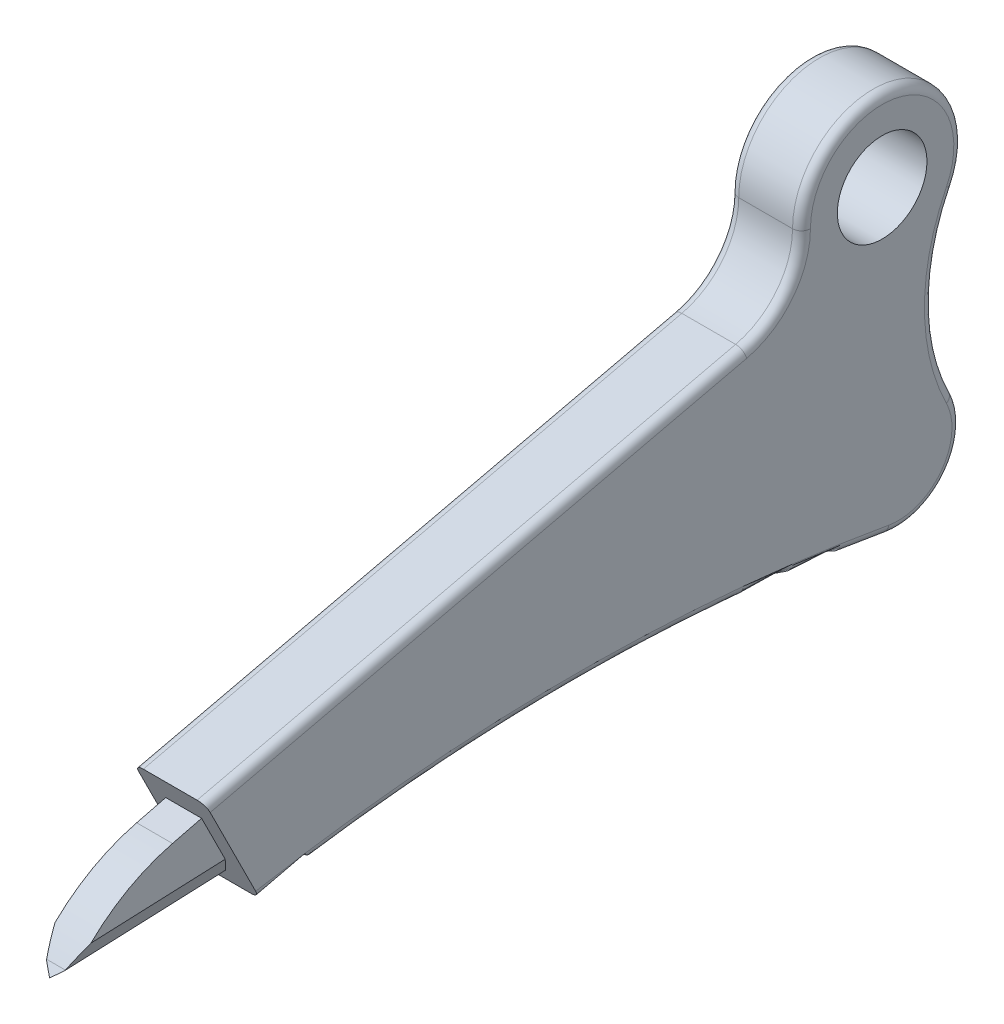
ISO-10303-21;
HEADER;
FILE_DESCRIPTION(('STEP AP214'),'2;1');
FILE_NAME('part.step','',(''),(''),'','','');
FILE_SCHEMA(('AUTOMOTIVE_DESIGN { 1 0 10303 214 1 1 1 1 }'));
ENDSEC;
DATA;
#1=APPLICATION_CONTEXT('core data for automotive mechanical design processes');
#2=APPLICATION_PROTOCOL_DEFINITION('international standard','automotive_design',2000,#1);
#3=PRODUCT_CONTEXT('',#1,'mechanical');
#4=PRODUCT('Part','Part','',(#3));
#5=PRODUCT_RELATED_PRODUCT_CATEGORY('part','',(#4));
#6=PRODUCT_DEFINITION_FORMATION('','',#4);
#7=PRODUCT_DEFINITION_CONTEXT('part definition',#1,'design');
#8=PRODUCT_DEFINITION('design','',#6,#7);
#9=PRODUCT_DEFINITION_SHAPE('','',#8);
#10=(LENGTH_UNIT() NAMED_UNIT(*) SI_UNIT(.MILLI.,.METRE.));
#11=(NAMED_UNIT(*) PLANE_ANGLE_UNIT() SI_UNIT($,.RADIAN.));
#12=(NAMED_UNIT(*) SI_UNIT($,.STERADIAN.) SOLID_ANGLE_UNIT());
#13=UNCERTAINTY_MEASURE_WITH_UNIT(LENGTH_MEASURE(1.E-05),#10,'distance_accuracy_value','');
#14=(GEOMETRIC_REPRESENTATION_CONTEXT(3) GLOBAL_UNCERTAINTY_ASSIGNED_CONTEXT((#13)) GLOBAL_UNIT_ASSIGNED_CONTEXT((#10,
#11,#12)) REPRESENTATION_CONTEXT('',''));
#15=CARTESIAN_POINT('',(0.,0.,0.));
#16=DIRECTION('',(0.,0.,1.));
#17=DIRECTION('',(1.,0.,0.));
#18=AXIS2_PLACEMENT_3D('',#15,#16,#17);
#19=CARTESIAN_POINT('',(5.08,0.,21.8621874453234));
#20=DIRECTION('',(1.,0.,0.));
#21=DIRECTION('',(0.,0.,-1.));
#22=AXIS2_PLACEMENT_3D('',#19,#20,#21);
#23=PLANE('',#22);
#24=DIRECTION('',(0.,-0.894427190999916,-0.447213595499959));
#25=VECTOR('',#24,1.);
#26=CARTESIAN_POINT('',(5.08,-43.18,88.1774609571593));
#27=LINE('',#26,#25);
#28=CARTESIAN_POINT('',(5.08,-29.1079464923485,95.2134877109851));
#29=VERTEX_POINT('',#28);
#30=CARTESIAN_POINT('',(5.08,-41.9956321296084,88.7696448923551));
#31=VERTEX_POINT('',#30);
#32=EDGE_CURVE('E329',#29,#31,#27,.T.);
#33=ORIENTED_EDGE('',*,*,#32,.T.);
#34=CARTESIAN_POINT('',(5.08,-293.260382077443,43.7274609571594));
#35=DIRECTION('',(1.,0.,0.));
#36=DIRECTION('',(0.,0.,-1.));
#37=AXIS2_PLACEMENT_3D('',#34,#35,#36);
#38=CIRCLE('',#37,255.27);
#39=CARTESIAN_POINT('',(5.08,-41.9295980896128,-0.944789042840671));
#40=VERTEX_POINT('',#39);
#41=EDGE_CURVE('E702',#31,#40,#38,.F.);
#42=ORIENTED_EDGE('',*,*,#41,.T.);
#43=CARTESIAN_POINT('',(5.08,-34.4298905377637,-2.27780844208511));
#44=DIRECTION('',(1.,0.,0.));
#45=DIRECTION('',(0.,0.,-1.));
#46=AXIS2_PLACEMENT_3D('',#43,#44,#45);
#47=CIRCLE('',#46,7.61725370996823);
#48=CARTESIAN_POINT('',(5.08,-31.0444444444444,-9.10139319141257));
#49=VERTEX_POINT('',#48);
#50=EDGE_CURVE('E224',#40,#49,#47,.T.);
#51=ORIENTED_EDGE('',*,*,#50,.T.);
#52=CARTESIAN_POINT('',(5.08,-17.78,-35.8367356911871));
#53=DIRECTION('',(1.,0.,0.));
#54=DIRECTION('',(0.,0.,-1.));
#55=AXIS2_PLACEMENT_3D('',#52,#53,#54);
#56=CIRCLE('',#55,29.845);
#57=CARTESIAN_POINT('',(5.08,-4.51555555555555,-9.10139319141259));
#58=VERTEX_POINT('',#57);
#59=EDGE_CURVE('E686',#49,#58,#56,.F.);
#60=ORIENTED_EDGE('',*,*,#59,.T.);
#61=CARTESIAN_POINT('',(5.08,0.,0.));
#62=DIRECTION('',(1.,0.,0.));
#63=DIRECTION('',(0.,0.,-1.));
#64=AXIS2_PLACEMENT_3D('',#61,#62,#63);
#65=CIRCLE('',#64,10.16);
#66=CARTESIAN_POINT('',(5.08,0.,10.16));
#67=VERTEX_POINT('',#66);
#68=EDGE_CURVE('E691',#58,#67,#65,.T.);
#69=ORIENTED_EDGE('',*,*,#68,.T.);
#70=CARTESIAN_POINT('',(5.08,0.,21.8621874453234));
#71=DIRECTION('',(1.,0.,0.));
#72=DIRECTION('',(0.,0.,-1.));
#73=AXIS2_PLACEMENT_3D('',#70,#71,#72);
#74=CIRCLE('',#73,11.7021874453234);
#75=CARTESIAN_POINT('',(5.08,-11.396864278717,19.2065000356326));
#76=VERTEX_POINT('',#75);
#77=EDGE_CURVE('E694',#67,#76,#74,.F.);
#78=ORIENTED_EDGE('',*,*,#77,.T.);
#79=DIRECTION('',(0.,-0.226939401039256,0.973908880879492));
#80=VECTOR('',#79,1.);
#81=CARTESIAN_POINT('',(5.08,-29.176864278717,95.5092479178395));
#82=LINE('',#81,#80);
#83=EDGE_CURVE('E697',#76,#29,#82,.T.);
#84=ORIENTED_EDGE('',*,*,#83,.T.);
#85=EDGE_LOOP('',(#33,#42,#51,#60,#69,#78,#84));
#86=FACE_BOUND('',#85,.T.);
#87=CARTESIAN_POINT('',(5.08,0.,0.));
#88=DIRECTION('',(1.,0.,0.));
#89=DIRECTION('',(0.,0.,-1.));
#90=AXIS2_PLACEMENT_3D('',#87,#88,#89);
#91=CIRCLE('',#90,6.35);
#92=CARTESIAN_POINT('',(5.08,0.,-6.35));
#93=VERTEX_POINT('',#92);
#94=EDGE_CURVE('E322',#93,#93,#91,.T.);
#95=ORIENTED_EDGE('',*,*,#94,.F.);
#96=EDGE_LOOP('',(#95));
#97=FACE_BOUND('',#96,.T.);
#98=ADVANCED_FACE('F32',(#86,#97),#23,.T.);
#99=CARTESIAN_POINT('',(-5.08,0.,21.8621874453234));
#100=DIRECTION('',(1.,0.,0.));
#101=DIRECTION('',(0.,0.,-1.));
#102=AXIS2_PLACEMENT_3D('',#99,#100,#101);
#103=PLANE('',#102);
#104=CARTESIAN_POINT('',(-5.08,-34.4298905377637,-2.27780844208511));
#105=DIRECTION('',(1.,0.,0.));
#106=DIRECTION('',(0.,0.,-1.));
#107=AXIS2_PLACEMENT_3D('',#104,#105,#106);
#108=CIRCLE('',#107,7.61725370996823);
#109=CARTESIAN_POINT('',(-5.08,-31.0444444444444,-9.10139319141258));
#110=VERTEX_POINT('',#109);
#111=CARTESIAN_POINT('',(-5.08,-41.9295980896128,-0.944789042840671));
#112=VERTEX_POINT('',#111);
#113=EDGE_CURVE('E356',#110,#112,#108,.F.);
#114=ORIENTED_EDGE('',*,*,#113,.T.);
#115=CARTESIAN_POINT('',(-5.08,-293.260382077443,43.7274609571594));
#116=DIRECTION('',(1.,0.,0.));
#117=DIRECTION('',(0.,0.,-1.));
#118=AXIS2_PLACEMENT_3D('',#115,#116,#117);
#119=CIRCLE('',#118,255.27);
#120=CARTESIAN_POINT('',(-5.08,-41.9956321296084,88.7696448923551));
#121=VERTEX_POINT('',#120);
#122=EDGE_CURVE('E358',#112,#121,#119,.T.);
#123=ORIENTED_EDGE('',*,*,#122,.T.);
#124=DIRECTION('',(0.,-0.894427190999916,-0.447213595499959));
#125=VECTOR('',#124,1.);
#126=CARTESIAN_POINT('',(-5.08,-43.18,88.1774609571593));
#127=LINE('',#126,#125);
#128=CARTESIAN_POINT('',(-5.08,-29.1079464923485,95.2134877109851));
#129=VERTEX_POINT('',#128);
#130=EDGE_CURVE('E325',#129,#121,#127,.T.);
#131=ORIENTED_EDGE('',*,*,#130,.F.);
#132=DIRECTION('',(0.,-0.226939401039256,0.973908880879492));
#133=VECTOR('',#132,1.);
#134=CARTESIAN_POINT('',(-5.08,-11.396864278717,19.2065000356326));
#135=LINE('',#134,#133);
#136=CARTESIAN_POINT('',(-5.08,-11.396864278717,19.2065000356326));
#137=VERTEX_POINT('',#136);
#138=EDGE_CURVE('E348',#129,#137,#135,.F.);
#139=ORIENTED_EDGE('',*,*,#138,.T.);
#140=CARTESIAN_POINT('',(-5.08,0.,21.8621874453234));
#141=DIRECTION('',(1.,0.,0.));
#142=DIRECTION('',(0.,0.,-1.));
#143=AXIS2_PLACEMENT_3D('',#140,#141,#142);
#144=CIRCLE('',#143,11.7021874453234);
#145=CARTESIAN_POINT('',(-5.08,0.,10.16));
#146=VERTEX_POINT('',#145);
#147=EDGE_CURVE('E350',#137,#146,#144,.T.);
#148=ORIENTED_EDGE('',*,*,#147,.T.);
#149=CARTESIAN_POINT('',(-5.08,0.,0.));
#150=DIRECTION('',(1.,0.,0.));
#151=DIRECTION('',(0.,0.,-1.));
#152=AXIS2_PLACEMENT_3D('',#149,#150,#151);
#153=CIRCLE('',#152,10.16);
#154=CARTESIAN_POINT('',(-5.08,-4.51555555555555,-9.10139319141259));
#155=VERTEX_POINT('',#154);
#156=EDGE_CURVE('E352',#146,#155,#153,.F.);
#157=ORIENTED_EDGE('',*,*,#156,.T.);
#158=CARTESIAN_POINT('',(-5.08,-17.78,-35.8367356911871));
#159=DIRECTION('',(1.,0.,0.));
#160=DIRECTION('',(0.,0.,-1.));
#161=AXIS2_PLACEMENT_3D('',#158,#159,#160);
#162=CIRCLE('',#161,29.845);
#163=EDGE_CURVE('E354',#155,#110,#162,.T.);
#164=ORIENTED_EDGE('',*,*,#163,.T.);
#165=EDGE_LOOP('',(#114,#123,#131,#139,#148,#157,#164));
#166=FACE_BOUND('',#165,.T.);
#167=CARTESIAN_POINT('',(-5.08,0.,0.));
#168=DIRECTION('',(1.,0.,0.));
#169=DIRECTION('',(0.,0.,-1.));
#170=AXIS2_PLACEMENT_3D('',#167,#168,#169);
#171=CIRCLE('',#170,6.35);
#172=CARTESIAN_POINT('',(-5.08,0.,-6.35));
#173=VERTEX_POINT('',#172);
#174=EDGE_CURVE('E326',#173,#173,#171,.T.);
#175=ORIENTED_EDGE('',*,*,#174,.T.);
#176=EDGE_LOOP('',(#175));
#177=FACE_BOUND('',#176,.T.);
#178=ADVANCED_FACE('F389',(#166,#177),#103,.F.);
#179=CARTESIAN_POINT('',(5.08,0.,21.8621874453234));
#180=DIRECTION('',(-1.,0.,0.));
#181=DIRECTION('',(0.,0.,1.));
#182=AXIS2_PLACEMENT_3D('',#179,#180,#181);
#183=CYLINDRICAL_SURFACE('',#182,10.4321874453234);
#184=DIRECTION('',(-1.,0.,0.));
#185=VECTOR('',#184,1.);
#186=CARTESIAN_POINT('',(5.08,0.,11.43));
#187=LINE('',#186,#185);
#188=CARTESIAN_POINT('',(3.81,0.,11.43));
#189=VERTEX_POINT('',#188);
#190=CARTESIAN_POINT('',(-3.81,0.,11.43));
#191=VERTEX_POINT('',#190);
#192=EDGE_CURVE('E332',#189,#191,#187,.T.);
#193=ORIENTED_EDGE('',*,*,#192,.T.);
#194=CARTESIAN_POINT('',(-3.81,0.,21.8621874453234));
#195=DIRECTION('',(1.,0.,0.));
#196=DIRECTION('',(0.,0.,-1.));
#197=AXIS2_PLACEMENT_3D('',#194,#195,#196);
#198=CIRCLE('',#197,10.4321874453234);
#199=CARTESIAN_POINT('',(-3.81,-10.16,19.4947130749525));
#200=VERTEX_POINT('',#199);
#201=EDGE_CURVE('E722',#191,#200,#198,.F.);
#202=ORIENTED_EDGE('',*,*,#201,.T.);
#203=DIRECTION('',(-1.,0.,0.));
#204=VECTOR('',#203,1.);
#205=CARTESIAN_POINT('',(5.08,-10.16,19.4947130749525));
#206=LINE('',#205,#204);
#207=CARTESIAN_POINT('',(3.81,-10.16,19.4947130749525));
#208=VERTEX_POINT('',#207);
#209=EDGE_CURVE('E221',#208,#200,#206,.T.);
#210=ORIENTED_EDGE('',*,*,#209,.F.);
#211=CARTESIAN_POINT('',(3.81,0.,21.8621874453234));
#212=DIRECTION('',(1.,0.,0.));
#213=DIRECTION('',(0.,0.,-1.));
#214=AXIS2_PLACEMENT_3D('',#211,#212,#213);
#215=CIRCLE('',#214,10.4321874453234);
#216=EDGE_CURVE('E734',#208,#189,#215,.T.);
#217=ORIENTED_EDGE('',*,*,#216,.T.);
#218=EDGE_LOOP('',(#193,#202,#210,#217));
#219=FACE_BOUND('',#218,.T.);
#220=ADVANCED_FACE('F386',(#219),#183,.F.);
#221=CARTESIAN_POINT('',(5.08,-27.94,95.7974609571594));
#222=DIRECTION('',(0.,-0.973908880879492,-0.226939401039256));
#223=DIRECTION('',(0.,0.226939401039256,-0.973908880879492));
#224=AXIS2_PLACEMENT_3D('',#221,#222,#223);
#225=PLANE('',#224);
#226=ORIENTED_EDGE('',*,*,#209,.T.);
#227=DIRECTION('',(0.,-0.226939401039256,0.973908880879492));
#228=VECTOR('',#227,1.);
#229=CARTESIAN_POINT('',(-3.81,-27.94,95.7974609571594));
#230=LINE('',#229,#228);
#231=CARTESIAN_POINT('',(-3.81,-27.94,95.7974609571594));
#232=VERTEX_POINT('',#231);
#233=EDGE_CURVE('E251',#200,#232,#230,.T.);
#234=ORIENTED_EDGE('',*,*,#233,.T.);
#235=DIRECTION('',(-1.,0.,0.));
#236=VECTOR('',#235,1.);
#237=CARTESIAN_POINT('',(5.08,-27.94,95.7974609571594));
#238=LINE('',#237,#236);
#239=CARTESIAN_POINT('',(3.81,-27.94,95.7974609571594));
#240=VERTEX_POINT('',#239);
#241=EDGE_CURVE('E342',#240,#232,#238,.T.);
#242=ORIENTED_EDGE('',*,*,#241,.F.);
#243=DIRECTION('',(0.,-0.226939401039256,0.973908880879492));
#244=VECTOR('',#243,1.);
#245=CARTESIAN_POINT('',(3.81,-10.16,19.4947130749525));
#246=LINE('',#245,#244);
#247=EDGE_CURVE('E704',#240,#208,#246,.F.);
#248=ORIENTED_EDGE('',*,*,#247,.T.);
#249=EDGE_LOOP('',(#226,#234,#242,#248));
#250=FACE_BOUND('',#249,.T.);
#251=ADVANCED_FACE('F381',(#250),#225,.F.);
#252=CARTESIAN_POINT('',(5.08,-43.18,88.1774609571593));
#253=DIRECTION('',(0.,0.447213595499959,-0.894427190999916));
#254=DIRECTION('',(0.,0.894427190999916,0.447213595499959));
#255=AXIS2_PLACEMENT_3D('',#252,#253,#254);
#256=PLANE('',#255);
#257=DIRECTION('',(-1.,0.,0.));
#258=VECTOR('',#257,1.);
#259=CARTESIAN_POINT('',(2.54,-31.75,93.8924609571593));
#260=LINE('',#259,#258);
#261=CARTESIAN_POINT('',(2.54,-31.75,93.8924609571593));
#262=VERTEX_POINT('',#261);
#263=CARTESIAN_POINT('',(-2.54,-31.75,93.8924609571593));
#264=VERTEX_POINT('',#263);
#265=EDGE_CURVE('E227',#262,#264,#260,.T.);
#266=ORIENTED_EDGE('',*,*,#265,.F.);
#267=DIRECTION('',(0.,-0.894427190999916,-0.447213595499959));
#268=VECTOR('',#267,1.);
#269=CARTESIAN_POINT('',(2.54,-43.18,88.1774609571593));
#270=LINE('',#269,#268);
#271=CARTESIAN_POINT('',(2.54,-38.4405814738173,90.5471702202507));
#272=VERTEX_POINT('',#271);
#273=EDGE_CURVE('E254',#262,#272,#270,.T.);
#274=ORIENTED_EDGE('',*,*,#273,.T.);
#275=DIRECTION('',(-0.391404746419297,-0.823068563112671,-0.411534281556336));
#276=VECTOR('',#275,1.);
#277=CARTESIAN_POINT('',(1.02060006747844,-41.6356636252082,88.9496291445552));
#278=LINE('',#277,#276);
#279=CARTESIAN_POINT('',(1.30009301484015,-41.0479296728491,89.2434961207348));
#280=VERTEX_POINT('',#279);
#281=EDGE_CURVE('E268',#272,#280,#278,.T.);
#282=ORIENTED_EDGE('',*,*,#281,.T.);
#283=DIRECTION('',(-0.735959609524876,-0.60554996698736,-0.302774983493681));
#284=VECTOR('',#283,1.);
#285=CARTESIAN_POINT('',(2.15970485870235,-40.3406382441677,89.5971418350755));
#286=LINE('',#285,#284);
#287=CARTESIAN_POINT('',(0.148295858459683,-41.9956321296084,88.7696448923551));
#288=VERTEX_POINT('',#287);
#289=EDGE_CURVE('E11',#280,#288,#286,.T.);
#290=ORIENTED_EDGE('',*,*,#289,.T.);
#291=DIRECTION('',(1.,0.,0.));
#292=VECTOR('',#291,1.);
#293=CARTESIAN_POINT('',(5.08,-41.9956321296084,88.7696448923551));
#294=LINE('',#293,#292);
#295=CARTESIAN_POINT('',(-0.148295858459753,-41.9956321296084,88.7696448923551));
#296=VERTEX_POINT('',#295);
#297=EDGE_CURVE('E250',#296,#288,#294,.T.);
#298=ORIENTED_EDGE('',*,*,#297,.F.);
#299=DIRECTION('',(0.735959609524873,-0.605549966987363,-0.302774983493682));
#300=VECTOR('',#299,1.);
#301=CARTESIAN_POINT('',(3.34332245731399,-44.8685470674462,87.3331874234362));
#302=LINE('',#301,#300);
#303=CARTESIAN_POINT('',(-1.30009301484011,-41.0479296728492,89.2434961207347));
#304=VERTEX_POINT('',#303);
#305=EDGE_CURVE('E41',#296,#304,#302,.F.);
#306=ORIENTED_EDGE('',*,*,#305,.T.);
#307=DIRECTION('',(0.391404746419297,-0.823068563112671,-0.411534281556336));
#308=VECTOR('',#307,1.);
#309=CARTESIAN_POINT('',(0.535888315800232,-44.9087375182733,87.3130921980227));
#310=LINE('',#309,#308);
#311=CARTESIAN_POINT('',(-2.54,-38.4405814738173,90.5471702202507));
#312=VERTEX_POINT('',#311);
#313=EDGE_CURVE('E266',#304,#312,#310,.F.);
#314=ORIENTED_EDGE('',*,*,#313,.T.);
#315=DIRECTION('',(0.,-0.894427190999916,-0.447213595499959));
#316=VECTOR('',#315,1.);
#317=CARTESIAN_POINT('',(-2.54,-43.18,88.1774609571593));
#318=LINE('',#317,#316);
#319=EDGE_CURVE('E247',#264,#312,#318,.T.);
#320=ORIENTED_EDGE('',*,*,#319,.F.);
#321=EDGE_LOOP('',(#266,#274,#282,#290,#298,#306,#314,#320));
#322=FACE_BOUND('',#321,.T.);
#323=ORIENTED_EDGE('',*,*,#130,.T.);
#324=CARTESIAN_POINT('',(-5.08,-41.9956321296084,88.7696448923552));
#325=CARTESIAN_POINT('',(-5.07999889086556,-42.0300171218377,88.7524523962405));
#326=CARTESIAN_POINT('',(-5.07839268891439,-42.0643859253171,88.7352679945008));
#327=CARTESIAN_POINT('',(-5.0719794854881,-42.1328848538347,88.701018530242));
#328=CARTESIAN_POINT('',(-5.06717237407189,-42.1670149706341,88.6839534718423));
#329=CARTESIAN_POINT('',(-5.04796917925796,-42.268706424671,88.6331077448239));
#330=CARTESIAN_POINT('',(-5.0287912178021,-42.3355974413835,88.5996622364676));
#331=CARTESIAN_POINT('',(-4.97808444180934,-42.4655619354593,88.5346799894297));
#332=CARTESIAN_POINT('',(-4.94654462941391,-42.5286319555831,88.5031449793678));
#333=CARTESIAN_POINT('',(-4.87184726223058,-42.6489892510357,88.4429663316415));
#334=CARTESIAN_POINT('',(-4.8286958376291,-42.7062795558035,88.4143211792576));
#335=CARTESIAN_POINT('',(-4.73283076181103,-42.8121461434547,88.361387885432));
#336=CARTESIAN_POINT('',(-4.68032855545628,-42.8608754576752,88.3370232283217));
#337=CARTESIAN_POINT('',(-4.56656472912219,-42.9493688176302,88.2927765483442));
#338=CARTESIAN_POINT('',(-4.50530241649127,-42.9891321537938,88.2728948802625));
#339=CARTESIAN_POINT('',(-4.37841246836569,-43.0568328413325,88.2390445364931));
#340=CARTESIAN_POINT('',(-4.31305744124052,-43.0851795881412,88.2248711630887));
#341=CARTESIAN_POINT('',(-4.17784460690513,-43.1312008962956,88.2018605090115));
#342=CARTESIAN_POINT('',(-4.10799235982862,-43.1488883660709,88.1930167741239));
#343=CARTESIAN_POINT('',(-3.9995816128375,-43.16726651312,88.1838277005994));
#344=CARTESIAN_POINT('',(-3.96183554875565,-43.1720393671845,88.1814412735671));
#345=CARTESIAN_POINT('',(-3.88606615821725,-43.1784044325297,88.1782587408945));
#346=CARTESIAN_POINT('',(-3.84804332483255,-43.18000134107,88.1774602866244));
#347=CARTESIAN_POINT('',(-3.80999999999999,-43.1799999999999,88.1774609571594));
#348=B_SPLINE_CURVE_WITH_KNOTS('',3,(#324,#325,#326,#327,#328,#329,#330,#331,#332,#333,#334,
#335,#336,#337,#338,#339,#340,#341,#342,#343,#344,#345,#346,#347),.UNSPECIFIED.,.F.,.F.,(4,2,2,
2,2,2,2,2,2,2,2,4),(0.,0.115261056802078,0.23052607266086,0.460961457806048,0.691602319411236,
0.922121655519614,1.14797063138101,1.37383747474732,1.59067023536904,1.80723988016088,
1.92145678858345,2.03550464289841),.UNSPECIFIED.);
#349=CARTESIAN_POINT('',(-3.81,-43.18,88.1774609571593));
#350=VERTEX_POINT('',#349);
#351=EDGE_CURVE('E201',#121,#350,#348,.T.);
#352=ORIENTED_EDGE('',*,*,#351,.T.);
#353=DIRECTION('',(-1.,0.,0.));
#354=VECTOR('',#353,1.);
#355=CARTESIAN_POINT('',(5.08,-43.18,88.1774609571593));
#356=LINE('',#355,#354);
#357=CARTESIAN_POINT('',(3.81,-43.18,88.1774609571593));
#358=VERTEX_POINT('',#357);
#359=EDGE_CURVE('E212',#358,#350,#356,.T.);
#360=ORIENTED_EDGE('',*,*,#359,.F.);
#361=CARTESIAN_POINT('',(3.81,-43.18,88.1774609571593));
#362=CARTESIAN_POINT('',(3.84466990764696,-43.1800004838377,88.1774607152405));
#363=CARTESIAN_POINT('',(3.87932281450361,-43.178674860689,88.1781235268148));
#364=CARTESIAN_POINT('',(3.94837229795204,-43.1733911100499,88.1807654021344));
#365=CARTESIAN_POINT('',(3.98276890761828,-43.1694333283973,88.1827442929607));
#366=CARTESIAN_POINT('',(4.08506499253537,-43.1536699912061,88.1906259615563));
#367=CARTESIAN_POINT('',(4.15226551737039,-43.1379741891178,88.1984738626005));
#368=CARTESIAN_POINT('',(4.28274177350235,-43.0967497127517,88.2190861007835));
#369=CARTESIAN_POINT('',(4.34601720825658,-43.071220296587,88.2318508088659));
#370=CARTESIAN_POINT('',(4.46700498633276,-43.0111801816584,88.2618708663301));
#371=CARTESIAN_POINT('',(4.52471649571461,-42.9766681394071,88.2791268874558));
#372=CARTESIAN_POINT('',(4.63407828584104,-42.8990744076346,88.317923753342));
#373=CARTESIAN_POINT('',(4.68560427500289,-42.8558528216647,88.339534546327));
#374=CARTESIAN_POINT('',(4.78018848577683,-42.7625403167888,88.3861907987649));
#375=CARTESIAN_POINT('',(4.82324461634758,-42.71244770673,88.4112371037943));
#376=CARTESIAN_POINT('',(4.90144545275853,-42.6047440417964,88.4650889362611));
#377=CARTESIAN_POINT('',(4.93621624217578,-42.5469159960967,88.494002959111));
#378=CARTESIAN_POINT('',(4.99485428323088,-42.4269948819536,88.5539635161825));
#379=CARTESIAN_POINT('',(5.01872177452982,-42.3649019072903,88.5850100035142));
#380=CARTESIAN_POINT('',(5.05121976503267,-42.2515787211769,88.6416715965709));
#381=CARTESIAN_POINT('',(5.06200664329423,-42.2008328035756,88.6670445553715));
#382=CARTESIAN_POINT('',(5.07639714036537,-42.0986058405164,88.7181580369011));
#383=CARTESIAN_POINT('',(5.08001096371661,-42.0471259444688,88.7438979849249));
#384=CARTESIAN_POINT('',(5.08,-41.9956321296084,88.7696448923551));
#385=B_SPLINE_CURVE_WITH_KNOTS('',3,(#361,#362,#363,#364,#365,#366,#367,#368,#369,#370,#371,
#372,#373,#374,#375,#376,#377,#378,#379,#380,#381,#382,#383,#384),.UNSPECIFIED.,.F.,.F.,(4,2,2,
2,2,2,2,2,2,2,2,4),(0.,0.10394450046553,0.207875346413036,0.415160246811974,0.622460788673012,
0.829792353297673,1.04076622011844,1.2517921070458,1.47104580299807,1.69029467938942,
1.86311255958124,2.03568440863786),.UNSPECIFIED.);
#386=EDGE_CURVE('E220',#358,#31,#385,.T.);
#387=ORIENTED_EDGE('',*,*,#386,.T.);
#388=ORIENTED_EDGE('',*,*,#32,.F.);
#389=CARTESIAN_POINT('',(3.81,-29.1079464923485,95.2134877109851));
#390=DIRECTION('',(0.,0.447213595499959,-0.894427190999916));
#391=DIRECTION('',(0.,-0.894427190999916,-0.447213595499959));
#392=AXIS2_PLACEMENT_3D('',#389,#390,#391);
#393=ELLIPSE('',#392,1.30580387548685,1.27);
#394=EDGE_CURVE('E360',#29,#240,#393,.F.);
#395=ORIENTED_EDGE('',*,*,#394,.T.);
#396=ORIENTED_EDGE('',*,*,#241,.T.);
#397=CARTESIAN_POINT('',(-3.81,-29.1079464923485,95.2134877109851));
#398=DIRECTION('',(0.,0.447213595499959,-0.894427190999916));
#399=DIRECTION('',(0.,0.894427190999916,0.447213595499959));
#400=AXIS2_PLACEMENT_3D('',#397,#398,#399);
#401=ELLIPSE('',#400,1.30580387548685,1.27);
#402=EDGE_CURVE('E362',#232,#129,#401,.F.);
#403=ORIENTED_EDGE('',*,*,#402,.T.);
#404=EDGE_LOOP('',(#323,#352,#360,#387,#388,#395,#396,#403));
#405=FACE_BOUND('',#404,.T.);
#406=ADVANCED_FACE('F299',(#322,#405),#256,.F.);
#407=CARTESIAN_POINT('',(5.08,-293.260382077443,43.7274609571594));
#408=DIRECTION('',(-1.,0.,0.));
#409=DIRECTION('',(0.,0.,1.));
#410=AXIS2_PLACEMENT_3D('',#407,#408,#409);
#411=CYLINDRICAL_SURFACE('',#410,254.);
#412=ORIENTED_EDGE('',*,*,#359,.T.);
#413=CARTESIAN_POINT('',(-3.81,-293.260382077443,43.7274609571594));
#414=DIRECTION('',(1.,0.,0.));
#415=DIRECTION('',(0.,0.,-1.));
#416=AXIS2_PLACEMENT_3D('',#413,#414,#415);
#417=CIRCLE('',#416,254.);
#418=CARTESIAN_POINT('',(-3.81,-43.18,-0.722539042840671));
#419=VERTEX_POINT('',#418);
#420=EDGE_CURVE('E211',#350,#419,#417,.F.);
#421=ORIENTED_EDGE('',*,*,#420,.T.);
#422=DIRECTION('',(-1.,0.,0.));
#423=VECTOR('',#422,1.);
#424=CARTESIAN_POINT('',(5.08,-43.18,-0.722539042840671));
#425=LINE('',#424,#423);
#426=CARTESIAN_POINT('',(3.81,-43.18,-0.722539042840671));
#427=VERTEX_POINT('',#426);
#428=EDGE_CURVE('E193',#427,#419,#425,.T.);
#429=ORIENTED_EDGE('',*,*,#428,.F.);
#430=CARTESIAN_POINT('',(3.81,-293.260382077443,43.7274609571594));
#431=DIRECTION('',(1.,0.,0.));
#432=DIRECTION('',(0.,0.,-1.));
#433=AXIS2_PLACEMENT_3D('',#430,#431,#432);
#434=CIRCLE('',#433,254.);
#435=EDGE_CURVE('E208',#427,#358,#434,.T.);
#436=ORIENTED_EDGE('',*,*,#435,.T.);
#437=EDGE_LOOP('',(#412,#421,#429,#436));
#438=FACE_BOUND('',#437,.T.);
#439=ADVANCED_FACE('F207',(#438),#411,.F.);
#440=CARTESIAN_POINT('',(5.08,-34.4298905377637,-2.27780844208511));
#441=DIRECTION('',(-1.,0.,0.));
#442=DIRECTION('',(0.,0.,1.));
#443=AXIS2_PLACEMENT_3D('',#440,#441,#442);
#444=CYLINDRICAL_SURFACE('',#443,8.88725370996823);
#445=ORIENTED_EDGE('',*,*,#428,.T.);
#446=CARTESIAN_POINT('',(-3.81,-34.4298905377637,-2.27780844208511));
#447=DIRECTION('',(1.,0.,0.));
#448=DIRECTION('',(0.,0.,-1.));
#449=AXIS2_PLACEMENT_3D('',#446,#447,#448);
#450=CIRCLE('',#449,8.88725370996823);
#451=CARTESIAN_POINT('',(-3.81,-30.48,-10.2390673403391));
#452=VERTEX_POINT('',#451);
#453=EDGE_CURVE('E200',#419,#452,#450,.T.);
#454=ORIENTED_EDGE('',*,*,#453,.T.);
#455=DIRECTION('',(-1.,0.,0.));
#456=VECTOR('',#455,1.);
#457=CARTESIAN_POINT('',(5.08,-30.48,-10.2390673403391));
#458=LINE('',#457,#456);
#459=CARTESIAN_POINT('',(3.81,-30.48,-10.2390673403391));
#460=VERTEX_POINT('',#459);
#461=EDGE_CURVE('E195',#460,#452,#458,.T.);
#462=ORIENTED_EDGE('',*,*,#461,.F.);
#463=CARTESIAN_POINT('',(3.81,-34.4298905377637,-2.27780844208511));
#464=DIRECTION('',(1.,0.,0.));
#465=DIRECTION('',(0.,0.,-1.));
#466=AXIS2_PLACEMENT_3D('',#463,#464,#465);
#467=CIRCLE('',#466,8.88725370996823);
#468=EDGE_CURVE('E190',#460,#427,#467,.F.);
#469=ORIENTED_EDGE('',*,*,#468,.T.);
#470=EDGE_LOOP('',(#445,#454,#462,#469));
#471=FACE_BOUND('',#470,.T.);
#472=ADVANCED_FACE('F192',(#471),#444,.T.);
#473=CARTESIAN_POINT('',(5.08,-17.78,-35.8367356911871));
#474=DIRECTION('',(-1.,0.,0.));
#475=DIRECTION('',(0.,0.,1.));
#476=AXIS2_PLACEMENT_3D('',#473,#474,#475);
#477=CYLINDRICAL_SURFACE('',#476,28.575);
#478=ORIENTED_EDGE('',*,*,#461,.T.);
#479=CARTESIAN_POINT('',(-3.81,-17.78,-35.8367356911871));
#480=DIRECTION('',(1.,0.,0.));
#481=DIRECTION('',(0.,0.,-1.));
#482=AXIS2_PLACEMENT_3D('',#479,#480,#481);
#483=CIRCLE('',#482,28.575);
#484=CARTESIAN_POINT('',(-3.81,-5.08,-10.2390673403392));
#485=VERTEX_POINT('',#484);
#486=EDGE_CURVE('E742',#452,#485,#483,.F.);
#487=ORIENTED_EDGE('',*,*,#486,.T.);
#488=DIRECTION('',(-1.,0.,0.));
#489=VECTOR('',#488,1.);
#490=CARTESIAN_POINT('',(5.08,-5.08,-10.2390673403392));
#491=LINE('',#490,#489);
#492=CARTESIAN_POINT('',(3.81,-5.08,-10.2390673403392));
#493=VERTEX_POINT('',#492);
#494=EDGE_CURVE('E337',#493,#485,#491,.T.);
#495=ORIENTED_EDGE('',*,*,#494,.F.);
#496=CARTESIAN_POINT('',(3.81,-17.78,-35.8367356911871));
#497=DIRECTION('',(1.,0.,0.));
#498=DIRECTION('',(0.,0.,-1.));
#499=AXIS2_PLACEMENT_3D('',#496,#497,#498);
#500=CIRCLE('',#499,28.575);
#501=EDGE_CURVE('E687',#493,#460,#500,.T.);
#502=ORIENTED_EDGE('',*,*,#501,.T.);
#503=EDGE_LOOP('',(#478,#487,#495,#502));
#504=FACE_BOUND('',#503,.T.);
#505=ADVANCED_FACE('F436',(#504),#477,.F.);
#506=CARTESIAN_POINT('',(5.08,0.,0.));
#507=DIRECTION('',(-1.,0.,0.));
#508=DIRECTION('',(0.,0.,1.));
#509=AXIS2_PLACEMENT_3D('',#506,#507,#508);
#510=CYLINDRICAL_SURFACE('',#509,11.43);
#511=ORIENTED_EDGE('',*,*,#494,.T.);
#512=CARTESIAN_POINT('',(-3.81,0.,0.));
#513=DIRECTION('',(1.,0.,0.));
#514=DIRECTION('',(0.,0.,-1.));
#515=AXIS2_PLACEMENT_3D('',#512,#513,#514);
#516=CIRCLE('',#515,11.43);
#517=EDGE_CURVE('E737',#485,#191,#516,.T.);
#518=ORIENTED_EDGE('',*,*,#517,.T.);
#519=ORIENTED_EDGE('',*,*,#192,.F.);
#520=CARTESIAN_POINT('',(3.81,0.,0.));
#521=DIRECTION('',(1.,0.,0.));
#522=DIRECTION('',(0.,0.,-1.));
#523=AXIS2_PLACEMENT_3D('',#520,#521,#522);
#524=CIRCLE('',#523,11.43);
#525=EDGE_CURVE('E690',#189,#493,#524,.F.);
#526=ORIENTED_EDGE('',*,*,#525,.T.);
#527=EDGE_LOOP('',(#511,#518,#519,#526));
#528=FACE_BOUND('',#527,.T.);
#529=ADVANCED_FACE('F419',(#528),#510,.T.);
#530=CARTESIAN_POINT('',(5.08,0.,0.));
#531=DIRECTION('',(-1.,0.,0.));
#532=DIRECTION('',(0.,0.,1.));
#533=AXIS2_PLACEMENT_3D('',#530,#531,#532);
#534=CYLINDRICAL_SURFACE('',#533,6.35);
#535=ORIENTED_EDGE('',*,*,#94,.T.);
#536=EDGE_LOOP('',(#535));
#537=FACE_BOUND('',#536,.T.);
#538=ORIENTED_EDGE('',*,*,#174,.F.);
#539=EDGE_LOOP('',(#538));
#540=FACE_BOUND('',#539,.T.);
#541=ADVANCED_FACE('F414',(#537,#540),#534,.F.);
#542=CARTESIAN_POINT('',(-3.81,-29.176864278717,95.5092479178395));
#543=DIRECTION('',(0.,-0.226939401039256,0.973908880879492));
#544=DIRECTION('',(0.,-0.973908880879492,-0.226939401039256));
#545=AXIS2_PLACEMENT_3D('',#542,#543,#544);
#546=CYLINDRICAL_SURFACE('',#545,1.27);
#547=ORIENTED_EDGE('',*,*,#402,.F.);
#548=ORIENTED_EDGE('',*,*,#233,.F.);
#549=CARTESIAN_POINT('',(-3.81,-11.396864278717,19.2065000356326));
#550=DIRECTION('',(0.,0.226939401039256,-0.973908880879492));
#551=DIRECTION('',(0.,0.973908880879492,0.226939401039256));
#552=AXIS2_PLACEMENT_3D('',#549,#550,#551);
#553=CIRCLE('',#552,1.27);
#554=EDGE_CURVE('E235',#137,#200,#553,.T.);
#555=ORIENTED_EDGE('',*,*,#554,.F.);
#556=ORIENTED_EDGE('',*,*,#138,.F.);
#557=EDGE_LOOP('',(#547,#548,#555,#556));
#558=FACE_BOUND('',#557,.T.);
#559=ADVANCED_FACE('F411',(#558),#546,.T.);
#560=CARTESIAN_POINT('',(-3.81,0.,21.8621874453234));
#561=DIRECTION('',(1.,0.,0.));
#562=DIRECTION('',(0.,0.,-1.));
#563=AXIS2_PLACEMENT_3D('',#560,#561,#562);
#564=TOROIDAL_SURFACE('',#563,11.7021874453234,1.27);
#565=ORIENTED_EDGE('',*,*,#554,.T.);
#566=ORIENTED_EDGE('',*,*,#201,.F.);
#567=CARTESIAN_POINT('',(-3.81,0.,10.16));
#568=DIRECTION('',(0.,1.,0.));
#569=DIRECTION('',(0.,0.,1.));
#570=AXIS2_PLACEMENT_3D('',#567,#568,#569);
#571=CIRCLE('',#570,1.27);
#572=EDGE_CURVE('E713',#146,#191,#571,.T.);
#573=ORIENTED_EDGE('',*,*,#572,.F.);
#574=ORIENTED_EDGE('',*,*,#147,.F.);
#575=EDGE_LOOP('',(#565,#566,#573,#574));
#576=FACE_BOUND('',#575,.T.);
#577=ADVANCED_FACE('F408',(#576),#564,.T.);
#578=CARTESIAN_POINT('',(-3.81,0.,0.));
#579=DIRECTION('',(1.,0.,0.));
#580=DIRECTION('',(0.,0.,-1.));
#581=AXIS2_PLACEMENT_3D('',#578,#579,#580);
#582=TOROIDAL_SURFACE('',#581,10.16,1.27);
#583=ORIENTED_EDGE('',*,*,#572,.T.);
#584=ORIENTED_EDGE('',*,*,#517,.F.);
#585=CARTESIAN_POINT('',(-3.81,-4.51555555555555,-9.10139319141259));
#586=DIRECTION('',(0.,-0.895806416477616,0.444444444444445));
#587=DIRECTION('',(0.,-0.444444444444445,-0.895806416477617));
#588=AXIS2_PLACEMENT_3D('',#585,#586,#587);
#589=CIRCLE('',#588,1.27);
#590=EDGE_CURVE('E711',#155,#485,#589,.T.);
#591=ORIENTED_EDGE('',*,*,#590,.F.);
#592=ORIENTED_EDGE('',*,*,#156,.F.);
#593=EDGE_LOOP('',(#583,#584,#591,#592));
#594=FACE_BOUND('',#593,.T.);
#595=ADVANCED_FACE('F404',(#594),#582,.T.);
#596=CARTESIAN_POINT('',(-3.81,-17.78,-35.8367356911871));
#597=DIRECTION('',(1.,0.,0.));
#598=DIRECTION('',(0.,0.,-1.));
#599=AXIS2_PLACEMENT_3D('',#596,#597,#598);
#600=TOROIDAL_SURFACE('',#599,29.845,1.27);
#601=ORIENTED_EDGE('',*,*,#590,.T.);
#602=ORIENTED_EDGE('',*,*,#486,.F.);
#603=CARTESIAN_POINT('',(-3.81,-31.0444444444444,-9.10139319141258));
#604=DIRECTION('',(0.,-0.895806416477616,-0.444444444444445));
#605=DIRECTION('',(0.,0.444444444444445,-0.895806416477616));
#606=AXIS2_PLACEMENT_3D('',#603,#604,#605);
#607=CIRCLE('',#606,1.27);
#608=EDGE_CURVE('E708',#110,#452,#607,.T.);
#609=ORIENTED_EDGE('',*,*,#608,.F.);
#610=ORIENTED_EDGE('',*,*,#163,.F.);
#611=EDGE_LOOP('',(#601,#602,#609,#610));
#612=FACE_BOUND('',#611,.T.);
#613=ADVANCED_FACE('F400',(#612),#600,.T.);
#614=CARTESIAN_POINT('',(-3.81,-34.4298905377637,-2.27780844208511));
#615=DIRECTION('',(1.,0.,0.));
#616=DIRECTION('',(0.,0.,-1.));
#617=AXIS2_PLACEMENT_3D('',#614,#615,#616);
#618=TOROIDAL_SURFACE('',#617,7.61725370996823,1.27);
#619=ORIENTED_EDGE('',*,*,#608,.T.);
#620=ORIENTED_EDGE('',*,*,#453,.F.);
#621=CARTESIAN_POINT('',(-3.81,-41.9295980896128,-0.944789042840671));
#622=DIRECTION('',(0.,0.175000000000001,0.984568433375761));
#623=DIRECTION('',(0.,-0.984568433375761,0.175000000000001));
#624=AXIS2_PLACEMENT_3D('',#621,#622,#623);
#625=CIRCLE('',#624,1.27);
#626=EDGE_CURVE('E246',#112,#419,#625,.T.);
#627=ORIENTED_EDGE('',*,*,#626,.F.);
#628=ORIENTED_EDGE('',*,*,#113,.F.);
#629=EDGE_LOOP('',(#619,#620,#627,#628));
#630=FACE_BOUND('',#629,.T.);
#631=ADVANCED_FACE('F396',(#630),#618,.T.);
#632=CARTESIAN_POINT('',(-3.81,-293.260382077443,43.7274609571594));
#633=DIRECTION('',(1.,0.,0.));
#634=DIRECTION('',(0.,0.,-1.));
#635=AXIS2_PLACEMENT_3D('',#632,#633,#634);
#636=TOROIDAL_SURFACE('',#635,255.27,1.27);
#637=ORIENTED_EDGE('',*,*,#351,.F.);
#638=ORIENTED_EDGE('',*,*,#122,.F.);
#639=ORIENTED_EDGE('',*,*,#626,.T.);
#640=ORIENTED_EDGE('',*,*,#420,.F.);
#641=EDGE_LOOP('',(#637,#638,#639,#640));
#642=FACE_BOUND('',#641,.T.);
#643=ADVANCED_FACE('F391',(#642),#636,.T.);
#644=CARTESIAN_POINT('',(3.81,-11.396864278717,19.2065000356326));
#645=DIRECTION('',(0.,0.226939401039256,-0.973908880879492));
#646=DIRECTION('',(0.,0.973908880879492,0.226939401039256));
#647=AXIS2_PLACEMENT_3D('',#644,#645,#646);
#648=CYLINDRICAL_SURFACE('',#647,1.27);
#649=ORIENTED_EDGE('',*,*,#394,.F.);
#650=ORIENTED_EDGE('',*,*,#83,.F.);
#651=CARTESIAN_POINT('',(3.81,-11.396864278717,19.2065000356326));
#652=DIRECTION('',(0.,0.226939401039256,-0.973908880879492));
#653=DIRECTION('',(0.,0.973908880879492,0.226939401039256));
#654=AXIS2_PLACEMENT_3D('',#651,#652,#653);
#655=CIRCLE('',#654,1.27);
#656=EDGE_CURVE('E243',#208,#76,#655,.T.);
#657=ORIENTED_EDGE('',*,*,#656,.F.);
#658=ORIENTED_EDGE('',*,*,#247,.F.);
#659=EDGE_LOOP('',(#649,#650,#657,#658));
#660=FACE_BOUND('',#659,.T.);
#661=ADVANCED_FACE('F395',(#660),#648,.T.);
#662=CARTESIAN_POINT('',(3.81,0.,21.8621874453234));
#663=DIRECTION('',(1.,0.,0.));
#664=DIRECTION('',(0.,0.,-1.));
#665=AXIS2_PLACEMENT_3D('',#662,#663,#664);
#666=TOROIDAL_SURFACE('',#665,11.7021874453234,1.27);
#667=ORIENTED_EDGE('',*,*,#656,.T.);
#668=ORIENTED_EDGE('',*,*,#77,.F.);
#669=CARTESIAN_POINT('',(3.81,0.,10.16));
#670=DIRECTION('',(0.,1.,0.));
#671=DIRECTION('',(0.,0.,1.));
#672=AXIS2_PLACEMENT_3D('',#669,#670,#671);
#673=CIRCLE('',#672,1.27);
#674=EDGE_CURVE('E240',#189,#67,#673,.T.);
#675=ORIENTED_EDGE('',*,*,#674,.F.);
#676=ORIENTED_EDGE('',*,*,#216,.F.);
#677=EDGE_LOOP('',(#667,#668,#675,#676));
#678=FACE_BOUND('',#677,.T.);
#679=ADVANCED_FACE('F541',(#678),#666,.T.);
#680=CARTESIAN_POINT('',(3.81,0.,0.));
#681=DIRECTION('',(1.,0.,0.));
#682=DIRECTION('',(0.,0.,-1.));
#683=AXIS2_PLACEMENT_3D('',#680,#681,#682);
#684=TOROIDAL_SURFACE('',#683,10.16,1.27);
#685=ORIENTED_EDGE('',*,*,#674,.T.);
#686=ORIENTED_EDGE('',*,*,#68,.F.);
#687=CARTESIAN_POINT('',(3.81,-4.51555555555555,-9.10139319141259));
#688=DIRECTION('',(0.,-0.895806416477617,0.444444444444444));
#689=DIRECTION('',(0.,-0.444444444444444,-0.895806416477617));
#690=AXIS2_PLACEMENT_3D('',#687,#688,#689);
#691=CIRCLE('',#690,1.27);
#692=EDGE_CURVE('E229',#493,#58,#691,.T.);
#693=ORIENTED_EDGE('',*,*,#692,.F.);
#694=ORIENTED_EDGE('',*,*,#525,.F.);
#695=EDGE_LOOP('',(#685,#686,#693,#694));
#696=FACE_BOUND('',#695,.T.);
#697=ADVANCED_FACE('F551',(#696),#684,.T.);
#698=CARTESIAN_POINT('',(3.81,-17.78,-35.8367356911871));
#699=DIRECTION('',(1.,0.,0.));
#700=DIRECTION('',(0.,0.,-1.));
#701=AXIS2_PLACEMENT_3D('',#698,#699,#700);
#702=TOROIDAL_SURFACE('',#701,29.845,1.27);
#703=ORIENTED_EDGE('',*,*,#692,.T.);
#704=ORIENTED_EDGE('',*,*,#59,.F.);
#705=CARTESIAN_POINT('',(3.81,-31.0444444444444,-9.10139319141258));
#706=DIRECTION('',(0.,-0.895806416477617,-0.444444444444444));
#707=DIRECTION('',(0.,0.444444444444444,-0.895806416477617));
#708=AXIS2_PLACEMENT_3D('',#705,#706,#707);
#709=CIRCLE('',#708,1.27);
#710=EDGE_CURVE('E226',#460,#49,#709,.T.);
#711=ORIENTED_EDGE('',*,*,#710,.F.);
#712=ORIENTED_EDGE('',*,*,#501,.F.);
#713=EDGE_LOOP('',(#703,#704,#711,#712));
#714=FACE_BOUND('',#713,.T.);
#715=ADVANCED_FACE('F561',(#714),#702,.T.);
#716=CARTESIAN_POINT('',(3.81,-34.4298905377637,-2.27780844208511));
#717=DIRECTION('',(1.,0.,0.));
#718=DIRECTION('',(0.,0.,-1.));
#719=AXIS2_PLACEMENT_3D('',#716,#717,#718);
#720=TOROIDAL_SURFACE('',#719,7.61725370996823,1.27);
#721=ORIENTED_EDGE('',*,*,#710,.T.);
#722=ORIENTED_EDGE('',*,*,#50,.F.);
#723=CARTESIAN_POINT('',(3.81,-41.9295980896128,-0.94478904284067));
#724=DIRECTION('',(0.,0.175,0.984568433375761));
#725=DIRECTION('',(0.,-0.984568433375761,0.175));
#726=AXIS2_PLACEMENT_3D('',#723,#724,#725);
#727=CIRCLE('',#726,1.27);
#728=EDGE_CURVE('E218',#427,#40,#727,.T.);
#729=ORIENTED_EDGE('',*,*,#728,.F.);
#730=ORIENTED_EDGE('',*,*,#468,.F.);
#731=EDGE_LOOP('',(#721,#722,#729,#730));
#732=FACE_BOUND('',#731,.T.);
#733=ADVANCED_FACE('F223',(#732),#720,.T.);
#734=CARTESIAN_POINT('',(3.81,-293.260382077443,43.7274609571594));
#735=DIRECTION('',(1.,0.,0.));
#736=DIRECTION('',(0.,0.,-1.));
#737=AXIS2_PLACEMENT_3D('',#734,#735,#736);
#738=TOROIDAL_SURFACE('',#737,255.27,1.27);
#739=ORIENTED_EDGE('',*,*,#386,.F.);
#740=ORIENTED_EDGE('',*,*,#435,.F.);
#741=ORIENTED_EDGE('',*,*,#728,.T.);
#742=ORIENTED_EDGE('',*,*,#41,.F.);
#743=EDGE_LOOP('',(#739,#740,#741,#742));
#744=FACE_BOUND('',#743,.T.);
#745=ADVANCED_FACE('F216',(#744),#738,.T.);
#746=CARTESIAN_POINT('',(2.54,-42.3396621923954,92.6224609571593));
#747=DIRECTION('',(0.,0.996037049703504,0.0889392805117098));
#748=DIRECTION('',(0.,-0.0889392805117098,0.996037049703503));
#749=AXIS2_PLACEMENT_3D('',#746,#747,#748);
#750=PLANE('',#749);
#751=DIRECTION('',(-0.0567635372511808,-0.0887958793147215,0.994431089948147));
#752=VECTOR('',#751,1.);
#753=CARTESIAN_POINT('',(-1.22287566059538,-44.1405721143565,112.790973622559));
#754=LINE('',#753,#752);
#755=CARTESIAN_POINT('',(0.,-42.2276131122662,91.3676156902343));
#756=VERTEX_POINT('',#755);
#757=EDGE_CURVE('E284',#288,#756,#754,.T.);
#758=ORIENTED_EDGE('',*,*,#757,.T.);
#759=DIRECTION('',(0.0567635372511802,-0.0887958793147215,0.994431089948147));
#760=VECTOR('',#759,1.);
#761=CARTESIAN_POINT('',(1.22287566059529,-44.1405721143565,112.790973622559));
#762=LINE('',#761,#760);
#763=EDGE_CURVE('E286',#756,#296,#762,.F.);
#764=ORIENTED_EDGE('',*,*,#763,.T.);
#765=ORIENTED_EDGE('',*,*,#297,.T.);
#766=EDGE_LOOP('',(#758,#764,#765));
#767=FACE_BOUND('',#766,.T.);
#768=ADVANCED_FACE('F587',(#767),#750,.F.);
#769=CARTESIAN_POINT('',(2.54,0.,0.));
#770=DIRECTION('',(1.,0.,0.));
#771=DIRECTION('',(0.,0.,-1.));
#772=AXIS2_PLACEMENT_3D('',#769,#770,#771);
#773=PLANE('',#772);
#774=DIRECTION('',(0.,-0.242535625036333,0.970142500145332));
#775=VECTOR('',#774,1.);
#776=CARTESIAN_POINT('',(2.54,-31.75,93.8924609571593));
#777=LINE('',#776,#775);
#778=CARTESIAN_POINT('',(2.54,-32.7800115229941,98.0125070491356));
#779=VERTEX_POINT('',#778);
#780=EDGE_CURVE('E232',#262,#779,#777,.T.);
#781=ORIENTED_EDGE('',*,*,#780,.T.);
#782=CARTESIAN_POINT('',(2.54,-57.4216310266855,91.8521021732128));
#783=DIRECTION('',(1.,0.,0.));
#784=DIRECTION('',(0.,0.,-1.));
#785=AXIS2_PLACEMENT_3D('',#782,#783,#784);
#786=CIRCLE('',#785,25.4);
#787=CARTESIAN_POINT('',(2.54,-39.2275200707063,109.57593715669));
#788=VERTEX_POINT('',#787);
#789=EDGE_CURVE('E279',#779,#788,#786,.T.);
#790=ORIENTED_EDGE('',*,*,#789,.T.);
#791=DIRECTION('',(0.,0.0413198884269569,-0.999145968725483));
#792=VECTOR('',#791,1.);
#793=CARTESIAN_POINT('',(2.54,-38.5329160515513,92.7798897320661));
#794=LINE('',#793,#792);
#795=EDGE_CURVE('E264',#788,#272,#794,.T.);
#796=ORIENTED_EDGE('',*,*,#795,.T.);
#797=ORIENTED_EDGE('',*,*,#273,.F.);
#798=EDGE_LOOP('',(#781,#790,#796,#797));
#799=FACE_BOUND('',#798,.T.);
#800=ADVANCED_FACE('F593',(#799),#773,.T.);
#801=CARTESIAN_POINT('',(-2.54,0.,0.));
#802=DIRECTION('',(1.,0.,0.));
#803=DIRECTION('',(0.,0.,-1.));
#804=AXIS2_PLACEMENT_3D('',#801,#802,#803);
#805=PLANE('',#804);
#806=DIRECTION('',(0.,-0.0413198884269569,0.999145968725483));
#807=VECTOR('',#806,1.);
#808=CARTESIAN_POINT('',(-2.54,-34.6367468944774,-1.4324098399538));
#809=LINE('',#808,#807);
#810=CARTESIAN_POINT('',(-2.54,-39.2275200707063,109.57593715669));
#811=VERTEX_POINT('',#810);
#812=EDGE_CURVE('E257',#312,#811,#809,.T.);
#813=ORIENTED_EDGE('',*,*,#812,.T.);
#814=CARTESIAN_POINT('',(-2.54,-57.4216310266855,91.8521021732128));
#815=DIRECTION('',(1.,0.,0.));
#816=DIRECTION('',(0.,0.,-1.));
#817=AXIS2_PLACEMENT_3D('',#814,#815,#816);
#818=CIRCLE('',#817,25.4);
#819=CARTESIAN_POINT('',(-2.54,-32.7800115229941,98.0125070491356));
#820=VERTEX_POINT('',#819);
#821=EDGE_CURVE('E275',#811,#820,#818,.F.);
#822=ORIENTED_EDGE('',*,*,#821,.T.);
#823=DIRECTION('',(0.,-0.242535625036333,0.970142500145332));
#824=VECTOR('',#823,1.);
#825=CARTESIAN_POINT('',(-2.54,-31.75,93.8924609571593));
#826=LINE('',#825,#824);
#827=EDGE_CURVE('E313',#264,#820,#826,.T.);
#828=ORIENTED_EDGE('',*,*,#827,.F.);
#829=ORIENTED_EDGE('',*,*,#319,.T.);
#830=EDGE_LOOP('',(#813,#822,#828,#829));
#831=FACE_BOUND('',#830,.T.);
#832=ADVANCED_FACE('F598',(#831),#805,.F.);
#833=CARTESIAN_POINT('',(2.54,-31.75,93.8924609571593));
#834=DIRECTION('',(0.,-0.970142500145332,-0.242535625036333));
#835=DIRECTION('',(0.,0.242535625036333,-0.970142500145332));
#836=AXIS2_PLACEMENT_3D('',#833,#834,#835);
#837=PLANE('',#836);
#838=ORIENTED_EDGE('',*,*,#827,.T.);
#839=DIRECTION('',(-1.,0.,0.));
#840=VECTOR('',#839,1.);
#841=CARTESIAN_POINT('',(2.54,-32.7800115229941,98.0125070491356));
#842=LINE('',#841,#840);
#843=EDGE_CURVE('E277',#820,#779,#842,.F.);
#844=ORIENTED_EDGE('',*,*,#843,.T.);
#845=ORIENTED_EDGE('',*,*,#780,.F.);
#846=ORIENTED_EDGE('',*,*,#265,.T.);
#847=EDGE_LOOP('',(#838,#844,#845,#846));
#848=FACE_BOUND('',#847,.T.);
#849=ADVANCED_FACE('F608',(#848),#837,.F.);
#850=CARTESIAN_POINT('',(2.54,-34.925,106.592460957159));
#851=DIRECTION('',(0.,-0.609710760849692,-0.7926239891046));
#852=DIRECTION('',(0.,0.7926239891046,-0.609710760849692));
#853=AXIS2_PLACEMENT_3D('',#850,#851,#852);
#854=PLANE('',#853);
#855=DIRECTION('',(-0.33667070999745,0.7463525403128,-0.574117338702153));
#856=VECTOR('',#855,1.);
#857=CARTESIAN_POINT('',(-0.763367822429451,-43.18,112.942460957159));
#858=LINE('',#857,#856);
#859=CARTESIAN_POINT('',(-1.32498250006761,-41.9349777011033,111.98475149647));
#860=VERTEX_POINT('',#859);
#861=CARTESIAN_POINT('',(-1.30009301484011,-41.9901542578248,112.02719500164));
#862=VERTEX_POINT('',#861);
#863=EDGE_CURVE('E262',#860,#862,#858,.F.);
#864=ORIENTED_EDGE('',*,*,#863,.T.);
#865=DIRECTION('',(-0.674566510129782,0.585126186487527,-0.450097066528866));
#866=VECTOR('',#865,1.);
#867=CARTESIAN_POINT('',(0.0716283478800379,-43.18,112.942460957159));
#868=LINE('',#867,#866);
#869=CARTESIAN_POINT('',(0.,-43.1178688069892,112.894667731766));
#870=VERTEX_POINT('',#869);
#871=EDGE_CURVE('E56',#862,#870,#868,.F.);
#872=ORIENTED_EDGE('',*,*,#871,.T.);
#873=DIRECTION('',(0.674566510129786,0.585126186487524,-0.450097066528864));
#874=VECTOR('',#873,1.);
#875=CARTESIAN_POINT('',(-0.0716283478801112,-43.18,112.942460957159));
#876=LINE('',#875,#874);
#877=CARTESIAN_POINT('',(1.30009301484016,-41.9901542578247,112.02719500164));
#878=VERTEX_POINT('',#877);
#879=EDGE_CURVE('E291',#870,#878,#876,.T.);
#880=ORIENTED_EDGE('',*,*,#879,.T.);
#881=DIRECTION('',(0.33667070999745,0.7463525403128,-0.574117338702153));
#882=VECTOR('',#881,1.);
#883=CARTESIAN_POINT('',(25.2187966133351,11.0343134538477,71.2391429157381));
#884=LINE('',#883,#882);
#885=CARTESIAN_POINT('',(1.32498250006762,-41.9349777011033,111.98475149647));
#886=VERTEX_POINT('',#885);
#887=EDGE_CURVE('E260',#878,#886,#884,.T.);
#888=ORIENTED_EDGE('',*,*,#887,.T.);
#889=DIRECTION('',(-1.,0.,0.));
#890=VECTOR('',#889,1.);
#891=CARTESIAN_POINT('',(2.54,-41.9349777011033,111.98475149647));
#892=LINE('',#891,#890);
#893=EDGE_CURVE('E270',#886,#860,#892,.T.);
#894=ORIENTED_EDGE('',*,*,#893,.T.);
#895=EDGE_LOOP('',(#864,#872,#880,#888,#894));
#896=FACE_BOUND('',#895,.T.);
#897=ADVANCED_FACE('F617',(#896),#854,.F.);
#898=CARTESIAN_POINT('',(-0.763367822429451,-43.18,112.942460957159));
#899=DIRECTION('',(0.906307787036651,0.422257332527989,0.0174625394223201));
#900=DIRECTION('',(0.,0.0413198884269569,-0.999145968725483));
#901=AXIS2_PLACEMENT_3D('',#898,#899,#900);
#902=PLANE('',#901);
#903=ORIENTED_EDGE('',*,*,#313,.F.);
#904=DIRECTION('',(0.,0.0413198884269569,-0.999145968725483));
#905=VECTOR('',#904,1.);
#906=CARTESIAN_POINT('',(-1.30009301484011,-42.0299721097605,112.990020598693));
#907=LINE('',#906,#905);
#908=EDGE_CURVE('E288',#304,#862,#907,.F.);
#909=ORIENTED_EDGE('',*,*,#908,.T.);
#910=ORIENTED_EDGE('',*,*,#863,.F.);
#911=CARTESIAN_POINT('',(6.27830658570793,-57.4216310266855,91.8521021732128));
#912=DIRECTION('',(0.906307787036651,0.422257332527989,0.0174625394223201));
#913=DIRECTION('',(-0.422618261740698,0.905533771842183,0.0374485366408367));
#914=AXIS2_PLACEMENT_3D('',#911,#912,#913);
#915=ELLIPSE('',#914,28.0257991416473,25.4);
#916=EDGE_CURVE('E273',#860,#811,#915,.F.);
#917=ORIENTED_EDGE('',*,*,#916,.T.);
#918=ORIENTED_EDGE('',*,*,#812,.F.);
#919=EDGE_LOOP('',(#903,#909,#910,#917,#918));
#920=FACE_BOUND('',#919,.T.);
#921=ADVANCED_FACE('F306',(#920),#902,.F.);
#922=CARTESIAN_POINT('',(2.54,-34.6367468944774,-1.4324098399538));
#923=DIRECTION('',(0.906307787036651,-0.422257332527989,-0.0174625394223201));
#924=DIRECTION('',(0.,-0.0413198884269569,0.999145968725483));
#925=AXIS2_PLACEMENT_3D('',#922,#923,#924);
#926=PLANE('',#925);
#927=ORIENTED_EDGE('',*,*,#887,.F.);
#928=DIRECTION('',(0.,0.041319888426957,-0.999145968725483));
#929=VECTOR('',#928,1.);
#930=CARTESIAN_POINT('',(1.30009301484015,-41.1896343021558,92.6700205986932));
#931=LINE('',#930,#929);
#932=EDGE_CURVE('E48',#878,#280,#931,.T.);
#933=ORIENTED_EDGE('',*,*,#932,.T.);
#934=ORIENTED_EDGE('',*,*,#281,.F.);
#935=ORIENTED_EDGE('',*,*,#795,.F.);
#936=CARTESIAN_POINT('',(-6.27830658570793,-57.4216310266855,91.8521021732128));
#937=DIRECTION('',(0.906307787036651,-0.422257332527989,-0.0174625394223201));
#938=DIRECTION('',(-0.422618261740698,-0.905533771842183,-0.0374485366408367));
#939=AXIS2_PLACEMENT_3D('',#936,#937,#938);
#940=ELLIPSE('',#939,28.0257991416473,25.4);
#941=EDGE_CURVE('E281',#788,#886,#940,.T.);
#942=ORIENTED_EDGE('',*,*,#941,.T.);
#943=EDGE_LOOP('',(#927,#933,#934,#935,#942));
#944=FACE_BOUND('',#943,.T.);
#945=ADVANCED_FACE('F627',(#944),#926,.T.);
#946=CARTESIAN_POINT('',(2.54,-57.4216310266855,91.8521021732128));
#947=DIRECTION('',(-1.,0.,0.));
#948=DIRECTION('',(0.,0.,1.));
#949=AXIS2_PLACEMENT_3D('',#946,#947,#948);
#950=CYLINDRICAL_SURFACE('',#949,25.4);
#951=ORIENTED_EDGE('',*,*,#789,.F.);
#952=ORIENTED_EDGE('',*,*,#843,.F.);
#953=ORIENTED_EDGE('',*,*,#821,.F.);
#954=ORIENTED_EDGE('',*,*,#916,.F.);
#955=ORIENTED_EDGE('',*,*,#893,.F.);
#956=ORIENTED_EDGE('',*,*,#941,.F.);
#957=EDGE_LOOP('',(#951,#952,#953,#954,#955,#956));
#958=FACE_BOUND('',#957,.T.);
#959=ADVANCED_FACE('F623',(#958),#950,.T.);
#960=CARTESIAN_POINT('',(-0.0716283478801112,-43.18,112.942460957159));
#961=DIRECTION('',(0.642787609686542,-0.765390217206883,-0.0316528709197665));
#962=DIRECTION('',(0.,0.0413198884269569,-0.999145968725483));
#963=AXIS2_PLACEMENT_3D('',#960,#961,#962);
#964=PLANE('',#963);
#965=ORIENTED_EDGE('',*,*,#932,.F.);
#966=ORIENTED_EDGE('',*,*,#879,.F.);
#967=DIRECTION('',(0.,0.0413198884269569,-0.999145968725483));
#968=VECTOR('',#967,1.);
#969=CARTESIAN_POINT('',(0.,-43.1199480098272,112.944944419648));
#970=LINE('',#969,#968);
#971=EDGE_CURVE('E36',#756,#870,#970,.F.);
#972=ORIENTED_EDGE('',*,*,#971,.F.);
#973=ORIENTED_EDGE('',*,*,#757,.F.);
#974=ORIENTED_EDGE('',*,*,#289,.F.);
#975=EDGE_LOOP('',(#965,#966,#972,#973,#974));
#976=FACE_BOUND('',#975,.T.);
#977=ADVANCED_FACE('F34',(#976),#964,.T.);
#978=CARTESIAN_POINT('',(0.0716283478800379,-43.18,112.942460957159));
#979=DIRECTION('',(0.642787609686546,0.765390217206879,0.0316528709197663));
#980=DIRECTION('',(0.,0.0413198884269569,-0.999145968725483));
#981=AXIS2_PLACEMENT_3D('',#978,#979,#980);
#982=PLANE('',#981);
#983=ORIENTED_EDGE('',*,*,#871,.F.);
#984=ORIENTED_EDGE('',*,*,#908,.F.);
#985=ORIENTED_EDGE('',*,*,#305,.F.);
#986=ORIENTED_EDGE('',*,*,#763,.F.);
#987=ORIENTED_EDGE('',*,*,#971,.T.);
#988=EDGE_LOOP('',(#983,#984,#985,#986,#987));
#989=FACE_BOUND('',#988,.T.);
#990=ADVANCED_FACE('F308',(#989),#982,.F.);
#991=CLOSED_SHELL('',(#98,#178,#220,#251,#406,#439,#472,#505,#529,#541,#559,#577,#595,#613,#631,
#643,#661,#679,#697,#715,#733,#745,#768,#800,#832,#849,#897,#921,#945,#959,#977,#990));
#992=MANIFOLD_SOLID_BREP('B2',#991);
#993=ADVANCED_BREP_SHAPE_REPRESENTATION('',(#18,#992),#14);
#994=SHAPE_DEFINITION_REPRESENTATION(#9,#993);
ENDSEC;
END-ISO-10303-21;
